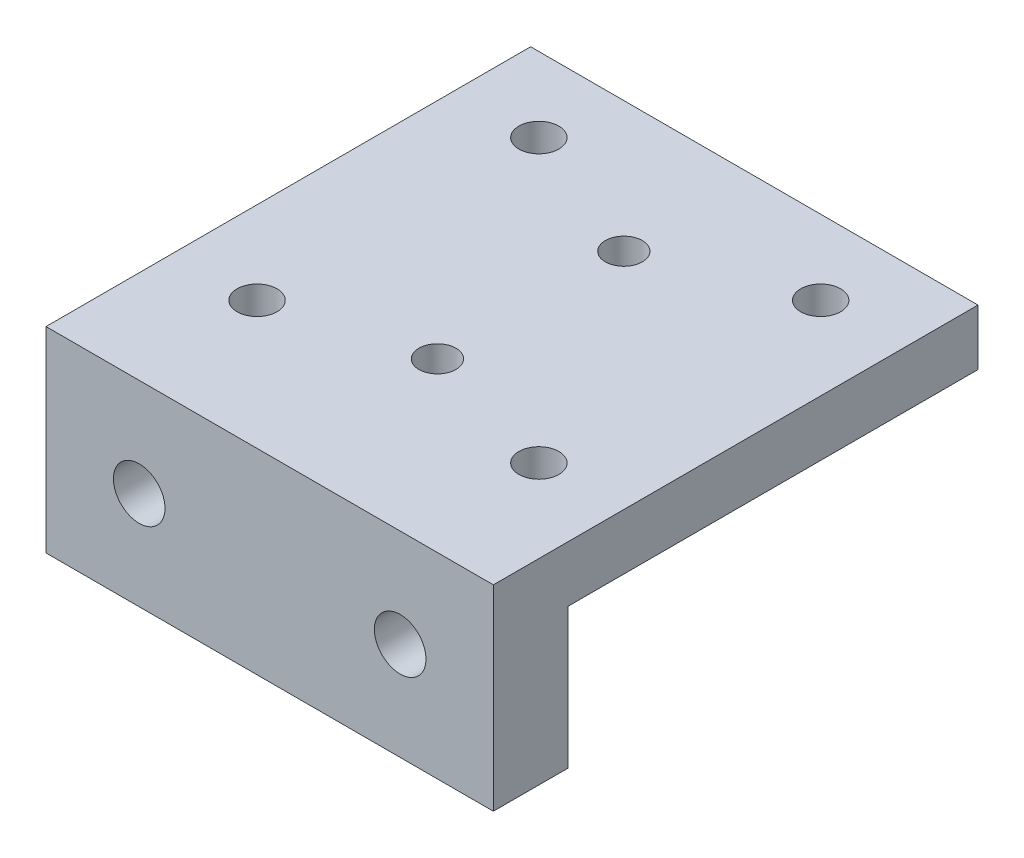
ISO-10303-21;
HEADER;
FILE_DESCRIPTION(('STEP AP214'),'2;1');
FILE_NAME('part.step','',(''),(''),'','','');
FILE_SCHEMA(('AUTOMOTIVE_DESIGN { 1 0 10303 214 1 1 1 1 }'));
ENDSEC;
DATA;
#1=APPLICATION_CONTEXT('core data for automotive mechanical design processes');
#2=APPLICATION_PROTOCOL_DEFINITION('international standard','automotive_design',2000,#1);
#3=PRODUCT_CONTEXT('',#1,'mechanical');
#4=PRODUCT('Part','Part','',(#3));
#5=PRODUCT_RELATED_PRODUCT_CATEGORY('part','',(#4));
#6=PRODUCT_DEFINITION_FORMATION('','',#4);
#7=PRODUCT_DEFINITION_CONTEXT('part definition',#1,'design');
#8=PRODUCT_DEFINITION('design','',#6,#7);
#9=PRODUCT_DEFINITION_SHAPE('','',#8);
#10=(LENGTH_UNIT() NAMED_UNIT(*) SI_UNIT(.MILLI.,.METRE.));
#11=(NAMED_UNIT(*) PLANE_ANGLE_UNIT() SI_UNIT($,.RADIAN.));
#12=(NAMED_UNIT(*) SI_UNIT($,.STERADIAN.) SOLID_ANGLE_UNIT());
#13=UNCERTAINTY_MEASURE_WITH_UNIT(LENGTH_MEASURE(1.E-05),#10,'distance_accuracy_value','');
#14=(GEOMETRIC_REPRESENTATION_CONTEXT(3) GLOBAL_UNCERTAINTY_ASSIGNED_CONTEXT((#13)) GLOBAL_UNIT_ASSIGNED_CONTEXT((#10,
#11,#12)) REPRESENTATION_CONTEXT('',''));
#15=CARTESIAN_POINT('',(0.,0.,0.));
#16=DIRECTION('',(0.,0.,1.));
#17=DIRECTION('',(1.,0.,0.));
#18=AXIS2_PLACEMENT_3D('',#15,#16,#17);
#19=CARTESIAN_POINT('',(19.05,-4.7625,-20.6375));
#20=DIRECTION('',(0.,0.,1.));
#21=DIRECTION('',(1.,0.,0.));
#22=AXIS2_PLACEMENT_3D('',#19,#20,#21);
#23=PLANE('',#22);
#24=DIRECTION('',(0.,1.,0.));
#25=VECTOR('',#24,1.);
#26=CARTESIAN_POINT('',(-19.05,-4.7625,-20.6375));
#27=LINE('',#26,#25);
#28=CARTESIAN_POINT('',(-19.05,-4.7625,-20.6375));
#29=VERTEX_POINT('',#28);
#30=CARTESIAN_POINT('',(-19.05,0.,-20.6375));
#31=VERTEX_POINT('',#30);
#32=EDGE_CURVE('E136',#29,#31,#27,.T.);
#33=ORIENTED_EDGE('',*,*,#32,.T.);
#34=DIRECTION('',(-1.,0.,0.));
#35=VECTOR('',#34,1.);
#36=CARTESIAN_POINT('',(19.05,0.,-20.6375));
#37=LINE('',#36,#35);
#38=CARTESIAN_POINT('',(19.05,0.,-20.6375));
#39=VERTEX_POINT('',#38);
#40=EDGE_CURVE('E13',#39,#31,#37,.T.);
#41=ORIENTED_EDGE('',*,*,#40,.F.);
#42=DIRECTION('',(0.,1.,0.));
#43=VECTOR('',#42,1.);
#44=CARTESIAN_POINT('',(19.05,-4.7625,-20.6375));
#45=LINE('',#44,#43);
#46=CARTESIAN_POINT('',(19.05,-4.7625,-20.6375));
#47=VERTEX_POINT('',#46);
#48=EDGE_CURVE('E147',#47,#39,#45,.T.);
#49=ORIENTED_EDGE('',*,*,#48,.F.);
#50=DIRECTION('',(-1.,0.,0.));
#51=VECTOR('',#50,1.);
#52=CARTESIAN_POINT('',(19.05,-4.7625,-20.6375));
#53=LINE('',#52,#51);
#54=EDGE_CURVE('E132',#47,#29,#53,.T.);
#55=ORIENTED_EDGE('',*,*,#54,.T.);
#56=EDGE_LOOP('',(#33,#41,#49,#55));
#57=FACE_BOUND('',#56,.T.);
#58=ADVANCED_FACE('F50',(#57),#23,.F.);
#59=CARTESIAN_POINT('',(19.05,0.,-20.6375));
#60=DIRECTION('',(0.,-1.,0.));
#61=DIRECTION('',(0.,0.,-1.));
#62=AXIS2_PLACEMENT_3D('',#59,#60,#61);
#63=PLANE('',#62);
#64=CARTESIAN_POINT('',(0.,0.,6.35));
#65=DIRECTION('',(0.,-1.,0.));
#66=DIRECTION('',(0.,0.,-1.));
#67=AXIS2_PLACEMENT_3D('',#64,#65,#66);
#68=CIRCLE('',#67,1.575);
#69=CARTESIAN_POINT('',(0.,0.,4.775));
#70=VERTEX_POINT('',#69);
#71=EDGE_CURVE('E159',#70,#70,#68,.T.);
#72=ORIENTED_EDGE('',*,*,#71,.T.);
#73=EDGE_LOOP('',(#72));
#74=FACE_BOUND('',#73,.T.);
#75=CARTESIAN_POINT('',(0.,0.,-9.525));
#76=DIRECTION('',(0.,-1.,0.));
#77=DIRECTION('',(0.,0.,-1.));
#78=AXIS2_PLACEMENT_3D('',#75,#76,#77);
#79=CIRCLE('',#78,1.575);
#80=CARTESIAN_POINT('',(0.,0.,-11.1));
#81=VERTEX_POINT('',#80);
#82=EDGE_CURVE('E174',#81,#81,#79,.T.);
#83=ORIENTED_EDGE('',*,*,#82,.T.);
#84=EDGE_LOOP('',(#83));
#85=FACE_BOUND('',#84,.T.);
#86=CARTESIAN_POINT('',(12.,0.,-14.2875));
#87=DIRECTION('',(0.,-1.,0.));
#88=DIRECTION('',(0.,0.,-1.));
#89=AXIS2_PLACEMENT_3D('',#86,#87,#88);
#90=CIRCLE('',#89,1.7);
#91=CARTESIAN_POINT('',(12.,0.,-15.9875));
#92=VERTEX_POINT('',#91);
#93=EDGE_CURVE('E180',#92,#92,#90,.T.);
#94=ORIENTED_EDGE('',*,*,#93,.T.);
#95=EDGE_LOOP('',(#94));
#96=FACE_BOUND('',#95,.T.);
#97=CARTESIAN_POINT('',(-12.,0.,-14.2875));
#98=DIRECTION('',(0.,-1.,0.));
#99=DIRECTION('',(0.,0.,-1.));
#100=AXIS2_PLACEMENT_3D('',#97,#98,#99);
#101=CIRCLE('',#100,1.7);
#102=CARTESIAN_POINT('',(-12.,0.,-15.9875));
#103=VERTEX_POINT('',#102);
#104=EDGE_CURVE('E186',#103,#103,#101,.T.);
#105=ORIENTED_EDGE('',*,*,#104,.T.);
#106=EDGE_LOOP('',(#105));
#107=FACE_BOUND('',#106,.T.);
#108=CARTESIAN_POINT('',(-12.0000000000003,0.,9.7125));
#109=DIRECTION('',(0.,-1.,0.));
#110=DIRECTION('',(0.,0.,-1.));
#111=AXIS2_PLACEMENT_3D('',#108,#109,#110);
#112=CIRCLE('',#111,1.7);
#113=CARTESIAN_POINT('',(-12.0000000000003,0.,8.0125));
#114=VERTEX_POINT('',#113);
#115=EDGE_CURVE('E192',#114,#114,#112,.T.);
#116=ORIENTED_EDGE('',*,*,#115,.T.);
#117=EDGE_LOOP('',(#116));
#118=FACE_BOUND('',#117,.T.);
#119=CARTESIAN_POINT('',(11.9999999999997,0.,9.7125));
#120=DIRECTION('',(0.,-1.,0.));
#121=DIRECTION('',(0.,0.,-1.));
#122=AXIS2_PLACEMENT_3D('',#119,#120,#121);
#123=CIRCLE('',#122,1.7);
#124=CARTESIAN_POINT('',(11.9999999999997,0.,8.0125));
#125=VERTEX_POINT('',#124);
#126=EDGE_CURVE('E140',#125,#125,#123,.T.);
#127=ORIENTED_EDGE('',*,*,#126,.T.);
#128=EDGE_LOOP('',(#127));
#129=FACE_BOUND('',#128,.T.);
#130=DIRECTION('',(0.,0.,1.));
#131=VECTOR('',#130,1.);
#132=CARTESIAN_POINT('',(-19.05,0.,-20.6375));
#133=LINE('',#132,#131);
#134=CARTESIAN_POINT('',(-19.05,0.,20.6375));
#135=VERTEX_POINT('',#134);
#136=EDGE_CURVE('E139',#31,#135,#133,.T.);
#137=ORIENTED_EDGE('',*,*,#136,.T.);
#138=DIRECTION('',(-1.,0.,0.));
#139=VECTOR('',#138,1.);
#140=CARTESIAN_POINT('',(19.05,0.,20.6375));
#141=LINE('',#140,#139);
#142=CARTESIAN_POINT('',(19.05,0.,20.6375));
#143=VERTEX_POINT('',#142);
#144=EDGE_CURVE('E59',#143,#135,#141,.T.);
#145=ORIENTED_EDGE('',*,*,#144,.F.);
#146=DIRECTION('',(0.,0.,1.));
#147=VECTOR('',#146,1.);
#148=CARTESIAN_POINT('',(19.05,0.,-20.6375));
#149=LINE('',#148,#147);
#150=EDGE_CURVE('E105',#39,#143,#149,.T.);
#151=ORIENTED_EDGE('',*,*,#150,.F.);
#152=ORIENTED_EDGE('',*,*,#40,.T.);
#153=EDGE_LOOP('',(#137,#145,#151,#152));
#154=FACE_BOUND('',#153,.T.);
#155=ADVANCED_FACE('F203',(#74,#85,#96,#107,#118,#129,#154),#63,.F.);
#156=CARTESIAN_POINT('',(19.05,0.,20.6375));
#157=DIRECTION('',(0.,0.,-1.));
#158=DIRECTION('',(0.,1.,0.));
#159=AXIS2_PLACEMENT_3D('',#156,#157,#158);
#160=PLANE('',#159);
#161=CARTESIAN_POINT('',(-11.1125,-8.35025000000001,20.6375));
#162=DIRECTION('',(0.,0.,1.));
#163=DIRECTION('',(1.,0.,0.));
#164=AXIS2_PLACEMENT_3D('',#161,#162,#163);
#165=CIRCLE('',#164,2.1971);
#166=CARTESIAN_POINT('',(-8.9154,-8.35025000000001,20.6375));
#167=VERTEX_POINT('',#166);
#168=EDGE_CURVE('E166',#167,#167,#165,.T.);
#169=ORIENTED_EDGE('',*,*,#168,.F.);
#170=EDGE_LOOP('',(#169));
#171=FACE_BOUND('',#170,.T.);
#172=CARTESIAN_POINT('',(11.1125,-8.35025000000001,20.6375));
#173=DIRECTION('',(0.,0.,1.));
#174=DIRECTION('',(1.,0.,0.));
#175=AXIS2_PLACEMENT_3D('',#172,#173,#174);
#176=CIRCLE('',#175,2.1971);
#177=CARTESIAN_POINT('',(13.3096,-8.35025000000001,20.6375));
#178=VERTEX_POINT('',#177);
#179=EDGE_CURVE('E155',#178,#178,#176,.T.);
#180=ORIENTED_EDGE('',*,*,#179,.F.);
#181=EDGE_LOOP('',(#180));
#182=FACE_BOUND('',#181,.T.);
#183=DIRECTION('',(0.,-1.,0.));
#184=VECTOR('',#183,1.);
#185=CARTESIAN_POINT('',(-19.05,0.,20.6375));
#186=LINE('',#185,#184);
#187=CARTESIAN_POINT('',(-19.05,-16.7005,20.6375));
#188=VERTEX_POINT('',#187);
#189=EDGE_CURVE('E142',#135,#188,#186,.T.);
#190=ORIENTED_EDGE('',*,*,#189,.T.);
#191=DIRECTION('',(-1.,0.,0.));
#192=VECTOR('',#191,1.);
#193=CARTESIAN_POINT('',(19.05,-16.7005,20.6375));
#194=LINE('',#193,#192);
#195=CARTESIAN_POINT('',(19.05,-16.7005,20.6375));
#196=VERTEX_POINT('',#195);
#197=EDGE_CURVE('E127',#196,#188,#194,.T.);
#198=ORIENTED_EDGE('',*,*,#197,.F.);
#199=DIRECTION('',(0.,-1.,0.));
#200=VECTOR('',#199,1.);
#201=CARTESIAN_POINT('',(19.05,0.,20.6375));
#202=LINE('',#201,#200);
#203=EDGE_CURVE('E118',#143,#196,#202,.T.);
#204=ORIENTED_EDGE('',*,*,#203,.F.);
#205=ORIENTED_EDGE('',*,*,#144,.T.);
#206=EDGE_LOOP('',(#190,#198,#204,#205));
#207=FACE_BOUND('',#206,.T.);
#208=ADVANCED_FACE('F206',(#171,#182,#207),#160,.F.);
#209=CARTESIAN_POINT('',(19.05,-16.7005,20.6375));
#210=DIRECTION('',(0.,1.,0.));
#211=DIRECTION('',(0.,0.,1.));
#212=AXIS2_PLACEMENT_3D('',#209,#210,#211);
#213=PLANE('',#212);
#214=DIRECTION('',(0.,0.,-1.));
#215=VECTOR('',#214,1.);
#216=CARTESIAN_POINT('',(-19.05,-16.7005,20.6375));
#217=LINE('',#216,#215);
#218=CARTESIAN_POINT('',(-19.05,-16.7005,14.2875));
#219=VERTEX_POINT('',#218);
#220=EDGE_CURVE('E126',#188,#219,#217,.T.);
#221=ORIENTED_EDGE('',*,*,#220,.T.);
#222=DIRECTION('',(-1.,0.,0.));
#223=VECTOR('',#222,1.);
#224=CARTESIAN_POINT('',(19.05,-16.7005,14.2875));
#225=LINE('',#224,#223);
#226=CARTESIAN_POINT('',(19.05,-16.7005,14.2875));
#227=VERTEX_POINT('',#226);
#228=EDGE_CURVE('E123',#227,#219,#225,.T.);
#229=ORIENTED_EDGE('',*,*,#228,.F.);
#230=DIRECTION('',(0.,0.,-1.));
#231=VECTOR('',#230,1.);
#232=CARTESIAN_POINT('',(19.05,-16.7005,20.6375));
#233=LINE('',#232,#231);
#234=EDGE_CURVE('E112',#196,#227,#233,.T.);
#235=ORIENTED_EDGE('',*,*,#234,.F.);
#236=ORIENTED_EDGE('',*,*,#197,.T.);
#237=EDGE_LOOP('',(#221,#229,#235,#236));
#238=FACE_BOUND('',#237,.T.);
#239=ADVANCED_FACE('F124',(#238),#213,.F.);
#240=CARTESIAN_POINT('',(19.05,-16.7005,14.2875));
#241=DIRECTION('',(0.,0.,1.));
#242=DIRECTION('',(0.,-1.,0.));
#243=AXIS2_PLACEMENT_3D('',#240,#241,#242);
#244=PLANE('',#243);
#245=CARTESIAN_POINT('',(-11.1125,-8.35025000000001,14.2875));
#246=DIRECTION('',(0.,0.,1.));
#247=DIRECTION('',(0.,-1.,0.));
#248=AXIS2_PLACEMENT_3D('',#245,#246,#247);
#249=CIRCLE('',#248,2.19709999999999);
#250=CARTESIAN_POINT('',(-11.1125,-10.54735,14.2875));
#251=VERTEX_POINT('',#250);
#252=EDGE_CURVE('E53',#251,#251,#249,.T.);
#253=ORIENTED_EDGE('',*,*,#252,.T.);
#254=EDGE_LOOP('',(#253));
#255=FACE_BOUND('',#254,.T.);
#256=CARTESIAN_POINT('',(11.1125,-8.35025000000001,14.2875));
#257=DIRECTION('',(0.,0.,1.));
#258=DIRECTION('',(0.,-1.,0.));
#259=AXIS2_PLACEMENT_3D('',#256,#257,#258);
#260=CIRCLE('',#259,2.19709999999999);
#261=CARTESIAN_POINT('',(11.1125,-10.54735,14.2875));
#262=VERTEX_POINT('',#261);
#263=EDGE_CURVE('E152',#262,#262,#260,.T.);
#264=ORIENTED_EDGE('',*,*,#263,.T.);
#265=EDGE_LOOP('',(#264));
#266=FACE_BOUND('',#265,.T.);
#267=DIRECTION('',(0.,1.,0.));
#268=VECTOR('',#267,1.);
#269=CARTESIAN_POINT('',(-19.05,-16.7005,14.2875));
#270=LINE('',#269,#268);
#271=CARTESIAN_POINT('',(-19.05,-4.7625,14.2875));
#272=VERTEX_POINT('',#271);
#273=EDGE_CURVE('E91',#219,#272,#270,.T.);
#274=ORIENTED_EDGE('',*,*,#273,.T.);
#275=DIRECTION('',(-1.,0.,0.));
#276=VECTOR('',#275,1.);
#277=CARTESIAN_POINT('',(19.05,-4.7625,14.2875));
#278=LINE('',#277,#276);
#279=CARTESIAN_POINT('',(19.05,-4.7625,14.2875));
#280=VERTEX_POINT('',#279);
#281=EDGE_CURVE('E128',#280,#272,#278,.T.);
#282=ORIENTED_EDGE('',*,*,#281,.F.);
#283=DIRECTION('',(0.,1.,0.));
#284=VECTOR('',#283,1.);
#285=CARTESIAN_POINT('',(19.05,-16.7005,14.2875));
#286=LINE('',#285,#284);
#287=EDGE_CURVE('E116',#227,#280,#286,.T.);
#288=ORIENTED_EDGE('',*,*,#287,.F.);
#289=ORIENTED_EDGE('',*,*,#228,.T.);
#290=EDGE_LOOP('',(#274,#282,#288,#289));
#291=FACE_BOUND('',#290,.T.);
#292=ADVANCED_FACE('F130',(#255,#266,#291),#244,.F.);
#293=CARTESIAN_POINT('',(19.05,-4.7625,14.2875));
#294=DIRECTION('',(0.,1.,0.));
#295=DIRECTION('',(0.,0.,1.));
#296=AXIS2_PLACEMENT_3D('',#293,#294,#295);
#297=PLANE('',#296);
#298=CARTESIAN_POINT('',(0.,-4.76250000000001,6.35));
#299=DIRECTION('',(0.,-1.,0.));
#300=DIRECTION('',(0.,0.,-1.));
#301=AXIS2_PLACEMENT_3D('',#298,#299,#300);
#302=CIRCLE('',#301,1.57499999999999);
#303=CARTESIAN_POINT('',(0.,-4.76250000000001,4.77500000000001));
#304=VERTEX_POINT('',#303);
#305=EDGE_CURVE('E154',#304,#304,#302,.T.);
#306=ORIENTED_EDGE('',*,*,#305,.F.);
#307=EDGE_LOOP('',(#306));
#308=FACE_BOUND('',#307,.T.);
#309=CARTESIAN_POINT('',(0.,-4.76250000000001,-9.525));
#310=DIRECTION('',(0.,-1.,0.));
#311=DIRECTION('',(0.,0.,-1.));
#312=AXIS2_PLACEMENT_3D('',#309,#310,#311);
#313=CIRCLE('',#312,1.57499999999999);
#314=CARTESIAN_POINT('',(0.,-4.76250000000001,-11.1));
#315=VERTEX_POINT('',#314);
#316=EDGE_CURVE('E171',#315,#315,#313,.T.);
#317=ORIENTED_EDGE('',*,*,#316,.F.);
#318=EDGE_LOOP('',(#317));
#319=FACE_BOUND('',#318,.T.);
#320=CARTESIAN_POINT('',(12.,-4.7625,-14.2875));
#321=DIRECTION('',(0.,-1.,0.));
#322=DIRECTION('',(0.,0.,-1.));
#323=AXIS2_PLACEMENT_3D('',#320,#321,#322);
#324=CIRCLE('',#323,1.69999999999999);
#325=CARTESIAN_POINT('',(12.,-4.7625,-15.9875));
#326=VERTEX_POINT('',#325);
#327=EDGE_CURVE('E177',#326,#326,#324,.T.);
#328=ORIENTED_EDGE('',*,*,#327,.F.);
#329=EDGE_LOOP('',(#328));
#330=FACE_BOUND('',#329,.T.);
#331=CARTESIAN_POINT('',(-12.,-4.7625,-14.2875));
#332=DIRECTION('',(0.,-1.,0.));
#333=DIRECTION('',(0.,0.,-1.));
#334=AXIS2_PLACEMENT_3D('',#331,#332,#333);
#335=CIRCLE('',#334,1.69999999999999);
#336=CARTESIAN_POINT('',(-12.,-4.7625,-15.9875));
#337=VERTEX_POINT('',#336);
#338=EDGE_CURVE('E183',#337,#337,#335,.T.);
#339=ORIENTED_EDGE('',*,*,#338,.F.);
#340=EDGE_LOOP('',(#339));
#341=FACE_BOUND('',#340,.T.);
#342=CARTESIAN_POINT('',(-12.0000000000003,-4.7625,9.7125));
#343=DIRECTION('',(0.,-1.,0.));
#344=DIRECTION('',(0.,0.,-1.));
#345=AXIS2_PLACEMENT_3D('',#342,#343,#344);
#346=CIRCLE('',#345,1.69999999999999);
#347=CARTESIAN_POINT('',(-12.0000000000003,-4.7625,8.01250000000001));
#348=VERTEX_POINT('',#347);
#349=EDGE_CURVE('E189',#348,#348,#346,.T.);
#350=ORIENTED_EDGE('',*,*,#349,.F.);
#351=EDGE_LOOP('',(#350));
#352=FACE_BOUND('',#351,.T.);
#353=CARTESIAN_POINT('',(11.9999999999997,-4.7625,9.7125));
#354=DIRECTION('',(0.,-1.,0.));
#355=DIRECTION('',(0.,0.,-1.));
#356=AXIS2_PLACEMENT_3D('',#353,#354,#355);
#357=CIRCLE('',#356,1.69999999999999);
#358=CARTESIAN_POINT('',(11.9999999999997,-4.7625,8.01250000000001));
#359=VERTEX_POINT('',#358);
#360=EDGE_CURVE('E195',#359,#359,#357,.T.);
#361=ORIENTED_EDGE('',*,*,#360,.F.);
#362=EDGE_LOOP('',(#361));
#363=FACE_BOUND('',#362,.T.);
#364=DIRECTION('',(0.,0.,-1.));
#365=VECTOR('',#364,1.);
#366=CARTESIAN_POINT('',(-19.05,-4.7625,14.2875));
#367=LINE('',#366,#365);
#368=EDGE_CURVE('E97',#272,#29,#367,.T.);
#369=ORIENTED_EDGE('',*,*,#368,.T.);
#370=ORIENTED_EDGE('',*,*,#54,.F.);
#371=DIRECTION('',(0.,0.,-1.));
#372=VECTOR('',#371,1.);
#373=CARTESIAN_POINT('',(19.05,-4.7625,14.2875));
#374=LINE('',#373,#372);
#375=EDGE_CURVE('E68',#280,#47,#374,.T.);
#376=ORIENTED_EDGE('',*,*,#375,.F.);
#377=ORIENTED_EDGE('',*,*,#281,.T.);
#378=EDGE_LOOP('',(#369,#370,#376,#377));
#379=FACE_BOUND('',#378,.T.);
#380=ADVANCED_FACE('F211',(#308,#319,#330,#341,#352,#363,#379),#297,.F.);
#381=CARTESIAN_POINT('',(19.05,0.,0.));
#382=DIRECTION('',(1.,0.,0.));
#383=DIRECTION('',(0.,0.,-1.));
#384=AXIS2_PLACEMENT_3D('',#381,#382,#383);
#385=PLANE('',#384);
#386=ORIENTED_EDGE('',*,*,#48,.T.);
#387=ORIENTED_EDGE('',*,*,#150,.T.);
#388=ORIENTED_EDGE('',*,*,#203,.T.);
#389=ORIENTED_EDGE('',*,*,#234,.T.);
#390=ORIENTED_EDGE('',*,*,#287,.T.);
#391=ORIENTED_EDGE('',*,*,#375,.T.);
#392=EDGE_LOOP('',(#386,#387,#388,#389,#390,#391));
#393=FACE_BOUND('',#392,.T.);
#394=ADVANCED_FACE('F114',(#393),#385,.T.);
#395=CARTESIAN_POINT('',(-19.05,0.,0.));
#396=DIRECTION('',(1.,0.,0.));
#397=DIRECTION('',(0.,0.,-1.));
#398=AXIS2_PLACEMENT_3D('',#395,#396,#397);
#399=PLANE('',#398);
#400=ORIENTED_EDGE('',*,*,#32,.F.);
#401=ORIENTED_EDGE('',*,*,#368,.F.);
#402=ORIENTED_EDGE('',*,*,#273,.F.);
#403=ORIENTED_EDGE('',*,*,#220,.F.);
#404=ORIENTED_EDGE('',*,*,#189,.F.);
#405=ORIENTED_EDGE('',*,*,#136,.F.);
#406=EDGE_LOOP('',(#400,#401,#402,#403,#404,#405));
#407=FACE_BOUND('',#406,.T.);
#408=ADVANCED_FACE('F209',(#407),#399,.F.);
#409=CARTESIAN_POINT('',(11.9999999999997,-4.7625,9.7125));
#410=DIRECTION('',(0.,-1.,0.));
#411=DIRECTION('',(0.,0.,-1.));
#412=AXIS2_PLACEMENT_3D('',#409,#410,#411);
#413=CYLINDRICAL_SURFACE('',#412,1.69999999999999);
#414=ORIENTED_EDGE('',*,*,#126,.F.);
#415=EDGE_LOOP('',(#414));
#416=FACE_BOUND('',#415,.T.);
#417=ORIENTED_EDGE('',*,*,#360,.T.);
#418=EDGE_LOOP('',(#417));
#419=FACE_BOUND('',#418,.T.);
#420=ADVANCED_FACE('F320',(#416,#419),#413,.F.);
#421=CARTESIAN_POINT('',(-12.0000000000003,-4.7625,9.7125));
#422=DIRECTION('',(0.,-1.,0.));
#423=DIRECTION('',(0.,0.,-1.));
#424=AXIS2_PLACEMENT_3D('',#421,#422,#423);
#425=CYLINDRICAL_SURFACE('',#424,1.69999999999999);
#426=ORIENTED_EDGE('',*,*,#115,.F.);
#427=EDGE_LOOP('',(#426));
#428=FACE_BOUND('',#427,.T.);
#429=ORIENTED_EDGE('',*,*,#349,.T.);
#430=EDGE_LOOP('',(#429));
#431=FACE_BOUND('',#430,.T.);
#432=ADVANCED_FACE('F312',(#428,#431),#425,.F.);
#433=CARTESIAN_POINT('',(-12.,-4.7625,-14.2875));
#434=DIRECTION('',(0.,-1.,0.));
#435=DIRECTION('',(0.,0.,-1.));
#436=AXIS2_PLACEMENT_3D('',#433,#434,#435);
#437=CYLINDRICAL_SURFACE('',#436,1.69999999999999);
#438=ORIENTED_EDGE('',*,*,#104,.F.);
#439=EDGE_LOOP('',(#438));
#440=FACE_BOUND('',#439,.T.);
#441=ORIENTED_EDGE('',*,*,#338,.T.);
#442=EDGE_LOOP('',(#441));
#443=FACE_BOUND('',#442,.T.);
#444=ADVANCED_FACE('F304',(#440,#443),#437,.F.);
#445=CARTESIAN_POINT('',(12.,-4.7625,-14.2875));
#446=DIRECTION('',(0.,-1.,0.));
#447=DIRECTION('',(0.,0.,-1.));
#448=AXIS2_PLACEMENT_3D('',#445,#446,#447);
#449=CYLINDRICAL_SURFACE('',#448,1.69999999999999);
#450=ORIENTED_EDGE('',*,*,#93,.F.);
#451=EDGE_LOOP('',(#450));
#452=FACE_BOUND('',#451,.T.);
#453=ORIENTED_EDGE('',*,*,#327,.T.);
#454=EDGE_LOOP('',(#453));
#455=FACE_BOUND('',#454,.T.);
#456=ADVANCED_FACE('F297',(#452,#455),#449,.F.);
#457=CARTESIAN_POINT('',(0.,-4.7625,-9.525));
#458=DIRECTION('',(0.,-1.,0.));
#459=DIRECTION('',(0.,0.,-1.));
#460=AXIS2_PLACEMENT_3D('',#457,#458,#459);
#461=CYLINDRICAL_SURFACE('',#460,1.57499999999999);
#462=ORIENTED_EDGE('',*,*,#82,.F.);
#463=EDGE_LOOP('',(#462));
#464=FACE_BOUND('',#463,.T.);
#465=ORIENTED_EDGE('',*,*,#316,.T.);
#466=EDGE_LOOP('',(#465));
#467=FACE_BOUND('',#466,.T.);
#468=ADVANCED_FACE('F292',(#464,#467),#461,.F.);
#469=CARTESIAN_POINT('',(0.,-4.7625,6.35));
#470=DIRECTION('',(0.,-1.,0.));
#471=DIRECTION('',(0.,0.,-1.));
#472=AXIS2_PLACEMENT_3D('',#469,#470,#471);
#473=CYLINDRICAL_SURFACE('',#472,1.57499999999999);
#474=ORIENTED_EDGE('',*,*,#71,.F.);
#475=EDGE_LOOP('',(#474));
#476=FACE_BOUND('',#475,.T.);
#477=ORIENTED_EDGE('',*,*,#305,.T.);
#478=EDGE_LOOP('',(#477));
#479=FACE_BOUND('',#478,.T.);
#480=ADVANCED_FACE('F263',(#476,#479),#473,.F.);
#481=CARTESIAN_POINT('',(11.1125,-8.35025000000001,20.6375));
#482=DIRECTION('',(0.,0.,1.));
#483=DIRECTION('',(1.,0.,0.));
#484=AXIS2_PLACEMENT_3D('',#481,#482,#483);
#485=CYLINDRICAL_SURFACE('',#484,2.19709999999999);
#486=ORIENTED_EDGE('',*,*,#179,.T.);
#487=EDGE_LOOP('',(#486));
#488=FACE_BOUND('',#487,.T.);
#489=ORIENTED_EDGE('',*,*,#263,.F.);
#490=EDGE_LOOP('',(#489));
#491=FACE_BOUND('',#490,.T.);
#492=ADVANCED_FACE('F256',(#488,#491),#485,.F.);
#493=CARTESIAN_POINT('',(-11.1125,-8.35025000000001,20.6375));
#494=DIRECTION('',(0.,0.,1.));
#495=DIRECTION('',(1.,0.,0.));
#496=AXIS2_PLACEMENT_3D('',#493,#494,#495);
#497=CYLINDRICAL_SURFACE('',#496,2.19709999999999);
#498=ORIENTED_EDGE('',*,*,#168,.T.);
#499=EDGE_LOOP('',(#498));
#500=FACE_BOUND('',#499,.T.);
#501=ORIENTED_EDGE('',*,*,#252,.F.);
#502=EDGE_LOOP('',(#501));
#503=FACE_BOUND('',#502,.T.);
#504=ADVANCED_FACE('F262',(#500,#503),#497,.F.);
#505=CLOSED_SHELL('',(#58,#155,#208,#239,#292,#380,#394,#408,#420,#432,#444,#456,#468,#480,#492,#504));
#506=MANIFOLD_SOLID_BREP('B2',#505);
#507=ADVANCED_BREP_SHAPE_REPRESENTATION('',(#18,#506),#14);
#508=SHAPE_DEFINITION_REPRESENTATION(#9,#507);
ENDSEC;
END-ISO-10303-21;
